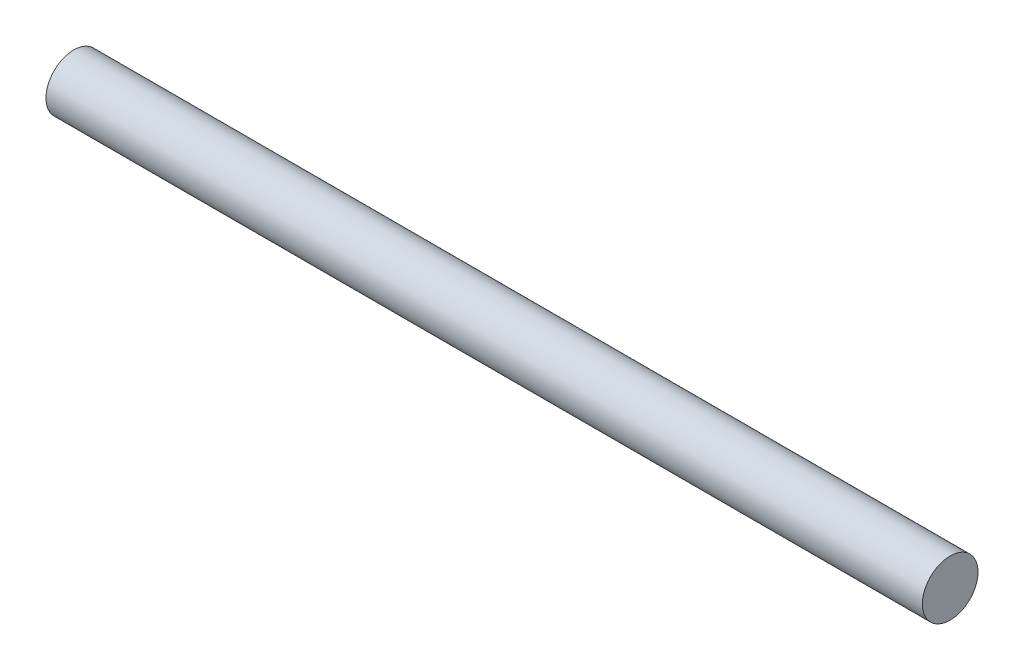
ISO-10303-21;
HEADER;
FILE_DESCRIPTION(('STEP AP214'),'2;1');
FILE_NAME('part.step','',(''),(''),'','','');
FILE_SCHEMA(('AUTOMOTIVE_DESIGN { 1 0 10303 214 1 1 1 1 }'));
ENDSEC;
DATA;
#1=APPLICATION_CONTEXT('core data for automotive mechanical design processes');
#2=APPLICATION_PROTOCOL_DEFINITION('international standard','automotive_design',2000,#1);
#3=PRODUCT_CONTEXT('',#1,'mechanical');
#4=PRODUCT('Part','Part','',(#3));
#5=PRODUCT_RELATED_PRODUCT_CATEGORY('part','',(#4));
#6=PRODUCT_DEFINITION_FORMATION('','',#4);
#7=PRODUCT_DEFINITION_CONTEXT('part definition',#1,'design');
#8=PRODUCT_DEFINITION('design','',#6,#7);
#9=PRODUCT_DEFINITION_SHAPE('','',#8);
#10=(LENGTH_UNIT() NAMED_UNIT(*) SI_UNIT(.MILLI.,.METRE.));
#11=(NAMED_UNIT(*) PLANE_ANGLE_UNIT() SI_UNIT($,.RADIAN.));
#12=(NAMED_UNIT(*) SI_UNIT($,.STERADIAN.) SOLID_ANGLE_UNIT());
#13=UNCERTAINTY_MEASURE_WITH_UNIT(LENGTH_MEASURE(1.E-05),#10,'distance_accuracy_value','');
#14=(GEOMETRIC_REPRESENTATION_CONTEXT(3) GLOBAL_UNCERTAINTY_ASSIGNED_CONTEXT((#13)) GLOBAL_UNIT_ASSIGNED_CONTEXT((#10,
#11,#12)) REPRESENTATION_CONTEXT('',''));
#15=CARTESIAN_POINT('',(0.,0.,0.));
#16=DIRECTION('',(0.,0.,1.));
#17=DIRECTION('',(1.,0.,0.));
#18=AXIS2_PLACEMENT_3D('',#15,#16,#17);
#19=CARTESIAN_POINT('',(400.,0.,0.));
#20=DIRECTION('',(-1.,0.,0.));
#21=DIRECTION('',(0.,0.,1.));
#22=AXIS2_PLACEMENT_3D('',#19,#20,#21);
#23=CYLINDRICAL_SURFACE('',#22,12.7);
#24=CARTESIAN_POINT('',(400.,0.,0.));
#25=DIRECTION('',(1.,0.,0.));
#26=DIRECTION('',(0.,0.,-1.));
#27=AXIS2_PLACEMENT_3D('',#24,#25,#26);
#28=CIRCLE('',#27,12.7);
#29=CARTESIAN_POINT('',(400.,0.,-12.7));
#30=VERTEX_POINT('',#29);
#31=EDGE_CURVE('E10',#30,#30,#28,.T.);
#32=ORIENTED_EDGE('',*,*,#31,.F.);
#33=EDGE_LOOP('',(#32));
#34=FACE_BOUND('',#33,.T.);
#35=CARTESIAN_POINT('',(0.,0.,0.));
#36=DIRECTION('',(1.,0.,0.));
#37=DIRECTION('',(0.,0.,-1.));
#38=AXIS2_PLACEMENT_3D('',#35,#36,#37);
#39=CIRCLE('',#38,12.7);
#40=CARTESIAN_POINT('',(0.,0.,-12.7));
#41=VERTEX_POINT('',#40);
#42=EDGE_CURVE('E40',#41,#41,#39,.T.);
#43=ORIENTED_EDGE('',*,*,#42,.T.);
#44=EDGE_LOOP('',(#43));
#45=FACE_BOUND('',#44,.T.);
#46=ADVANCED_FACE('F37',(#34,#45),#23,.T.);
#47=CARTESIAN_POINT('',(400.,0.,0.));
#48=DIRECTION('',(1.,0.,0.));
#49=DIRECTION('',(0.,0.,-1.));
#50=AXIS2_PLACEMENT_3D('',#47,#48,#49);
#51=PLANE('',#50);
#52=ORIENTED_EDGE('',*,*,#31,.T.);
#53=EDGE_LOOP('',(#52));
#54=FACE_BOUND('',#53,.T.);
#55=ADVANCED_FACE('F70',(#54),#51,.T.);
#56=CARTESIAN_POINT('',(0.,0.,0.));
#57=DIRECTION('',(1.,0.,0.));
#58=DIRECTION('',(0.,0.,-1.));
#59=AXIS2_PLACEMENT_3D('',#56,#57,#58);
#60=PLANE('',#59);
#61=CARTESIAN_POINT('',(0.,0.,0.));
#62=DIRECTION('',(-1.,0.,0.));
#63=DIRECTION('',(0.,0.,1.));
#64=AXIS2_PLACEMENT_3D('',#61,#62,#63);
#65=CIRCLE('',#64,4.7625);
#66=CARTESIAN_POINT('',(0.,0.,4.7625));
#67=VERTEX_POINT('',#66);
#68=EDGE_CURVE('E51',#67,#67,#65,.T.);
#69=ORIENTED_EDGE('',*,*,#68,.F.);
#70=EDGE_LOOP('',(#69));
#71=FACE_BOUND('',#70,.T.);
#72=ORIENTED_EDGE('',*,*,#42,.F.);
#73=EDGE_LOOP('',(#72));
#74=FACE_BOUND('',#73,.T.);
#75=ADVANCED_FACE('F64',(#71,#74),#60,.F.);
#76=CARTESIAN_POINT('',(30.,0.,0.));
#77=DIRECTION('',(-1.,0.,0.));
#78=DIRECTION('',(0.,0.,1.));
#79=AXIS2_PLACEMENT_3D('',#76,#77,#78);
#80=CYLINDRICAL_SURFACE('',#79,4.7625);
#81=CARTESIAN_POINT('',(30.,0.,0.));
#82=DIRECTION('',(-1.,0.,0.));
#83=DIRECTION('',(0.,0.,1.));
#84=AXIS2_PLACEMENT_3D('',#81,#82,#83);
#85=CIRCLE('',#84,4.7625);
#86=CARTESIAN_POINT('',(30.,0.,4.7625));
#87=VERTEX_POINT('',#86);
#88=EDGE_CURVE('E49',#87,#87,#85,.T.);
#89=ORIENTED_EDGE('',*,*,#88,.F.);
#90=EDGE_LOOP('',(#89));
#91=FACE_BOUND('',#90,.T.);
#92=ORIENTED_EDGE('',*,*,#68,.T.);
#93=EDGE_LOOP('',(#92));
#94=FACE_BOUND('',#93,.T.);
#95=ADVANCED_FACE('F61',(#91,#94),#80,.F.);
#96=CARTESIAN_POINT('',(30.,0.,0.));
#97=DIRECTION('',(-1.,0.,0.));
#98=DIRECTION('',(0.,0.,1.));
#99=AXIS2_PLACEMENT_3D('',#96,#97,#98);
#100=PLANE('',#99);
#101=ORIENTED_EDGE('',*,*,#88,.T.);
#102=EDGE_LOOP('',(#101));
#103=FACE_BOUND('',#102,.T.);
#104=ADVANCED_FACE('F59',(#103),#100,.T.);
#105=CLOSED_SHELL('',(#46,#55,#75,#95,#104));
#106=MANIFOLD_SOLID_BREP('B2',#105);
#107=ADVANCED_BREP_SHAPE_REPRESENTATION('',(#18,#106),#14);
#108=SHAPE_DEFINITION_REPRESENTATION(#9,#107);
ENDSEC;
END-ISO-10303-21;
